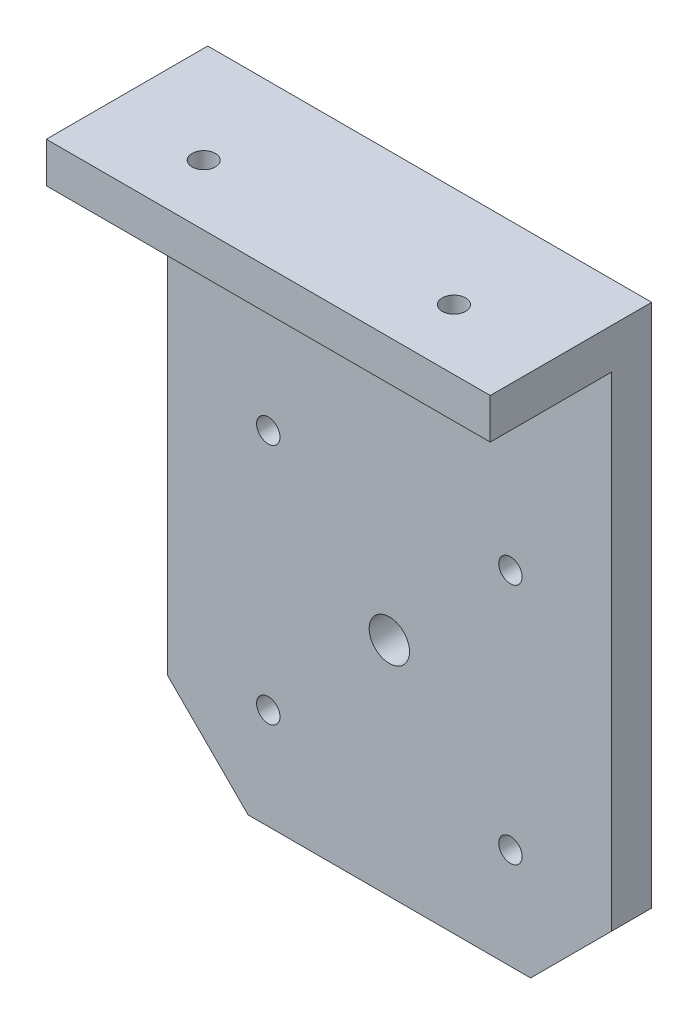
ISO-10303-21;
HEADER;
FILE_DESCRIPTION(('STEP AP214'),'2;1');
FILE_NAME('part.step','',(''),(''),'','','');
FILE_SCHEMA(('AUTOMOTIVE_DESIGN { 1 0 10303 214 1 1 1 1 }'));
ENDSEC;
DATA;
#1=APPLICATION_CONTEXT('core data for automotive mechanical design processes');
#2=APPLICATION_PROTOCOL_DEFINITION('international standard','automotive_design',2000,#1);
#3=PRODUCT_CONTEXT('',#1,'mechanical');
#4=PRODUCT('Part','Part','',(#3));
#5=PRODUCT_RELATED_PRODUCT_CATEGORY('part','',(#4));
#6=PRODUCT_DEFINITION_FORMATION('','',#4);
#7=PRODUCT_DEFINITION_CONTEXT('part definition',#1,'design');
#8=PRODUCT_DEFINITION('design','',#6,#7);
#9=PRODUCT_DEFINITION_SHAPE('','',#8);
#10=(LENGTH_UNIT() NAMED_UNIT(*) SI_UNIT(.MILLI.,.METRE.));
#11=(NAMED_UNIT(*) PLANE_ANGLE_UNIT() SI_UNIT($,.RADIAN.));
#12=(NAMED_UNIT(*) SI_UNIT($,.STERADIAN.) SOLID_ANGLE_UNIT());
#13=UNCERTAINTY_MEASURE_WITH_UNIT(LENGTH_MEASURE(1.E-05),#10,'distance_accuracy_value','');
#14=(GEOMETRIC_REPRESENTATION_CONTEXT(3) GLOBAL_UNCERTAINTY_ASSIGNED_CONTEXT((#13)) GLOBAL_UNIT_ASSIGNED_CONTEXT((#10,
#11,#12)) REPRESENTATION_CONTEXT('',''));
#15=CARTESIAN_POINT('',(0.,0.,0.));
#16=DIRECTION('',(0.,0.,1.));
#17=DIRECTION('',(1.,0.,0.));
#18=AXIS2_PLACEMENT_3D('',#15,#16,#17);
#19=CARTESIAN_POINT('',(-27.5,37.5,5.));
#20=DIRECTION('',(1.,0.,0.));
#21=DIRECTION('',(0.,1.,0.));
#22=AXIS2_PLACEMENT_3D('',#19,#20,#21);
#23=PLANE('',#22);
#24=DIRECTION('',(0.,-1.,0.));
#25=VECTOR('',#24,1.);
#26=CARTESIAN_POINT('',(-27.5,37.5,0.));
#27=LINE('',#26,#25);
#28=CARTESIAN_POINT('',(-27.5,37.5,0.));
#29=VERTEX_POINT('',#28);
#30=CARTESIAN_POINT('',(-27.5,-27.5,0.));
#31=VERTEX_POINT('',#30);
#32=EDGE_CURVE('E147',#29,#31,#27,.T.);
#33=ORIENTED_EDGE('',*,*,#32,.T.);
#34=DIRECTION('',(0.,0.,-1.));
#35=VECTOR('',#34,1.);
#36=CARTESIAN_POINT('',(-27.5,-27.5,5.));
#37=LINE('',#36,#35);
#38=CARTESIAN_POINT('',(-27.5,-27.5,5.));
#39=VERTEX_POINT('',#38);
#40=EDGE_CURVE('E11',#39,#31,#37,.T.);
#41=ORIENTED_EDGE('',*,*,#40,.F.);
#42=DIRECTION('',(0.,-1.,0.));
#43=VECTOR('',#42,1.);
#44=CARTESIAN_POINT('',(-27.5,37.5,5.));
#45=LINE('',#44,#43);
#46=CARTESIAN_POINT('',(-27.5,32.5,5.));
#47=VERTEX_POINT('',#46);
#48=EDGE_CURVE('E88',#47,#39,#45,.T.);
#49=ORIENTED_EDGE('',*,*,#48,.F.);
#50=DIRECTION('',(0.,0.,-1.));
#51=VECTOR('',#50,1.);
#52=CARTESIAN_POINT('',(-27.5,32.5,20.));
#53=LINE('',#52,#51);
#54=CARTESIAN_POINT('',(-27.5,32.5,20.));
#55=VERTEX_POINT('',#54);
#56=EDGE_CURVE('E109',#55,#47,#53,.T.);
#57=ORIENTED_EDGE('',*,*,#56,.F.);
#58=DIRECTION('',(0.,-1.,0.));
#59=VECTOR('',#58,1.);
#60=CARTESIAN_POINT('',(-27.5,37.5,20.));
#61=LINE('',#60,#59);
#62=CARTESIAN_POINT('',(-27.5,37.5,20.));
#63=VERTEX_POINT('',#62);
#64=EDGE_CURVE('E116',#63,#55,#61,.T.);
#65=ORIENTED_EDGE('',*,*,#64,.F.);
#66=DIRECTION('',(0.,0.,-1.));
#67=VECTOR('',#66,1.);
#68=CARTESIAN_POINT('',(-27.5,37.5,5.));
#69=LINE('',#68,#67);
#70=EDGE_CURVE('E163',#63,#29,#69,.T.);
#71=ORIENTED_EDGE('',*,*,#70,.T.);
#72=EDGE_LOOP('',(#33,#41,#49,#57,#65,#71));
#73=FACE_BOUND('',#72,.T.);
#74=ADVANCED_FACE('F33',(#73),#23,.F.);
#75=CARTESIAN_POINT('',(-17.5,-37.5,5.));
#76=DIRECTION('',(0.707106781186548,0.707106781186547,0.));
#77=DIRECTION('',(-0.707106781186547,0.707106781186548,0.));
#78=AXIS2_PLACEMENT_3D('',#75,#76,#77);
#79=PLANE('',#78);
#80=DIRECTION('',(0.707106781186547,-0.707106781186548,0.));
#81=VECTOR('',#80,1.);
#82=CARTESIAN_POINT('',(-17.5,-37.5,0.));
#83=LINE('',#82,#81);
#84=CARTESIAN_POINT('',(-17.5,-37.5,0.));
#85=VERTEX_POINT('',#84);
#86=EDGE_CURVE('E172',#31,#85,#83,.T.);
#87=ORIENTED_EDGE('',*,*,#86,.T.);
#88=DIRECTION('',(0.,0.,-1.));
#89=VECTOR('',#88,1.);
#90=CARTESIAN_POINT('',(-17.5,-37.5,5.));
#91=LINE('',#90,#89);
#92=CARTESIAN_POINT('',(-17.5,-37.5,5.));
#93=VERTEX_POINT('',#92);
#94=EDGE_CURVE('E41',#93,#85,#91,.T.);
#95=ORIENTED_EDGE('',*,*,#94,.F.);
#96=DIRECTION('',(0.707106781186547,-0.707106781186548,0.));
#97=VECTOR('',#96,1.);
#98=CARTESIAN_POINT('',(-17.5,-37.5,5.));
#99=LINE('',#98,#97);
#100=EDGE_CURVE('E150',#39,#93,#99,.T.);
#101=ORIENTED_EDGE('',*,*,#100,.F.);
#102=ORIENTED_EDGE('',*,*,#40,.T.);
#103=EDGE_LOOP('',(#87,#95,#101,#102));
#104=FACE_BOUND('',#103,.T.);
#105=ADVANCED_FACE('F183',(#104),#79,.F.);
#106=CARTESIAN_POINT('',(-17.5,-37.5,5.));
#107=DIRECTION('',(0.,1.,0.));
#108=DIRECTION('',(0.,0.,1.));
#109=AXIS2_PLACEMENT_3D('',#106,#107,#108);
#110=PLANE('',#109);
#111=DIRECTION('',(1.,0.,0.));
#112=VECTOR('',#111,1.);
#113=CARTESIAN_POINT('',(-17.5,-37.5,0.));
#114=LINE('',#113,#112);
#115=CARTESIAN_POINT('',(17.5,-37.5,0.));
#116=VERTEX_POINT('',#115);
#117=EDGE_CURVE('E170',#85,#116,#114,.T.);
#118=ORIENTED_EDGE('',*,*,#117,.T.);
#119=DIRECTION('',(0.,0.,-1.));
#120=VECTOR('',#119,1.);
#121=CARTESIAN_POINT('',(17.5,-37.5,5.));
#122=LINE('',#121,#120);
#123=CARTESIAN_POINT('',(17.5,-37.5,5.));
#124=VERTEX_POINT('',#123);
#125=EDGE_CURVE('E155',#124,#116,#122,.T.);
#126=ORIENTED_EDGE('',*,*,#125,.F.);
#127=DIRECTION('',(1.,0.,0.));
#128=VECTOR('',#127,1.);
#129=CARTESIAN_POINT('',(-17.5,-37.5,5.));
#130=LINE('',#129,#128);
#131=EDGE_CURVE('E176',#93,#124,#130,.T.);
#132=ORIENTED_EDGE('',*,*,#131,.F.);
#133=ORIENTED_EDGE('',*,*,#94,.T.);
#134=EDGE_LOOP('',(#118,#126,#132,#133));
#135=FACE_BOUND('',#134,.T.);
#136=ADVANCED_FACE('F186',(#135),#110,.F.);
#137=CARTESIAN_POINT('',(17.5,-37.5,5.));
#138=DIRECTION('',(-0.707106781186548,0.707106781186547,0.));
#139=DIRECTION('',(-0.707106781186547,-0.707106781186548,0.));
#140=AXIS2_PLACEMENT_3D('',#137,#138,#139);
#141=PLANE('',#140);
#142=DIRECTION('',(0.707106781186547,0.707106781186548,0.));
#143=VECTOR('',#142,1.);
#144=CARTESIAN_POINT('',(17.5,-37.5,0.));
#145=LINE('',#144,#143);
#146=CARTESIAN_POINT('',(27.5,-27.5,0.));
#147=VERTEX_POINT('',#146);
#148=EDGE_CURVE('E168',#116,#147,#145,.T.);
#149=ORIENTED_EDGE('',*,*,#148,.T.);
#150=DIRECTION('',(0.,0.,-1.));
#151=VECTOR('',#150,1.);
#152=CARTESIAN_POINT('',(27.5,-27.5,5.));
#153=LINE('',#152,#151);
#154=CARTESIAN_POINT('',(27.5,-27.5,5.));
#155=VERTEX_POINT('',#154);
#156=EDGE_CURVE('E158',#155,#147,#153,.T.);
#157=ORIENTED_EDGE('',*,*,#156,.F.);
#158=DIRECTION('',(0.707106781186547,0.707106781186548,0.));
#159=VECTOR('',#158,1.);
#160=CARTESIAN_POINT('',(17.5,-37.5,5.));
#161=LINE('',#160,#159);
#162=EDGE_CURVE('E56',#124,#155,#161,.T.);
#163=ORIENTED_EDGE('',*,*,#162,.F.);
#164=ORIENTED_EDGE('',*,*,#125,.T.);
#165=EDGE_LOOP('',(#149,#157,#163,#164));
#166=FACE_BOUND('',#165,.T.);
#167=ADVANCED_FACE('F189',(#166),#141,.F.);
#168=CARTESIAN_POINT('',(27.5,37.5,5.));
#169=DIRECTION('',(-1.,0.,0.));
#170=DIRECTION('',(0.,-1.,0.));
#171=AXIS2_PLACEMENT_3D('',#168,#169,#170);
#172=PLANE('',#171);
#173=DIRECTION('',(0.,1.,0.));
#174=VECTOR('',#173,1.);
#175=CARTESIAN_POINT('',(27.5,37.5,0.));
#176=LINE('',#175,#174);
#177=CARTESIAN_POINT('',(27.5,37.5,0.));
#178=VERTEX_POINT('',#177);
#179=EDGE_CURVE('E166',#147,#178,#176,.T.);
#180=ORIENTED_EDGE('',*,*,#179,.T.);
#181=DIRECTION('',(0.,0.,-1.));
#182=VECTOR('',#181,1.);
#183=CARTESIAN_POINT('',(27.5,37.5,5.));
#184=LINE('',#183,#182);
#185=CARTESIAN_POINT('',(27.5,37.5,20.));
#186=VERTEX_POINT('',#185);
#187=EDGE_CURVE('E161',#186,#178,#184,.T.);
#188=ORIENTED_EDGE('',*,*,#187,.F.);
#189=DIRECTION('',(0.,1.,0.));
#190=VECTOR('',#189,1.);
#191=CARTESIAN_POINT('',(27.5,37.5,20.));
#192=LINE('',#191,#190);
#193=CARTESIAN_POINT('',(27.5,32.5,20.));
#194=VERTEX_POINT('',#193);
#195=EDGE_CURVE('E115',#194,#186,#192,.T.);
#196=ORIENTED_EDGE('',*,*,#195,.F.);
#197=DIRECTION('',(0.,0.,-1.));
#198=VECTOR('',#197,1.);
#199=CARTESIAN_POINT('',(27.5,32.5,20.));
#200=LINE('',#199,#198);
#201=CARTESIAN_POINT('',(27.5,32.5,5.));
#202=VERTEX_POINT('',#201);
#203=EDGE_CURVE('E111',#194,#202,#200,.T.);
#204=ORIENTED_EDGE('',*,*,#203,.T.);
#205=DIRECTION('',(0.,1.,0.));
#206=VECTOR('',#205,1.);
#207=CARTESIAN_POINT('',(27.5,37.5,5.));
#208=LINE('',#207,#206);
#209=EDGE_CURVE('E138',#155,#202,#208,.T.);
#210=ORIENTED_EDGE('',*,*,#209,.F.);
#211=ORIENTED_EDGE('',*,*,#156,.T.);
#212=EDGE_LOOP('',(#180,#188,#196,#204,#210,#211));
#213=FACE_BOUND('',#212,.T.);
#214=ADVANCED_FACE('F193',(#213),#172,.F.);
#215=CARTESIAN_POINT('',(-27.5,37.5,5.));
#216=DIRECTION('',(0.,-1.,0.));
#217=DIRECTION('',(0.,0.,-1.));
#218=AXIS2_PLACEMENT_3D('',#215,#216,#217);
#219=PLANE('',#218);
#220=CARTESIAN_POINT('',(15.5,37.5,12.5));
#221=DIRECTION('',(0.,-1.,0.));
#222=DIRECTION('',(0.,0.,-1.));
#223=AXIS2_PLACEMENT_3D('',#220,#221,#222);
#224=CIRCLE('',#223,1.44999999999999);
#225=CARTESIAN_POINT('',(15.5,37.5,11.05));
#226=VERTEX_POINT('',#225);
#227=EDGE_CURVE('E203',#226,#226,#224,.T.);
#228=ORIENTED_EDGE('',*,*,#227,.T.);
#229=EDGE_LOOP('',(#228));
#230=FACE_BOUND('',#229,.T.);
#231=CARTESIAN_POINT('',(-15.5,37.5,12.5));
#232=DIRECTION('',(0.,-1.,0.));
#233=DIRECTION('',(0.,0.,-1.));
#234=AXIS2_PLACEMENT_3D('',#231,#232,#233);
#235=CIRCLE('',#234,1.44999999999999);
#236=CARTESIAN_POINT('',(-15.5,37.5,11.05));
#237=VERTEX_POINT('',#236);
#238=EDGE_CURVE('E137',#237,#237,#235,.T.);
#239=ORIENTED_EDGE('',*,*,#238,.T.);
#240=EDGE_LOOP('',(#239));
#241=FACE_BOUND('',#240,.T.);
#242=DIRECTION('',(-1.,0.,0.));
#243=VECTOR('',#242,1.);
#244=CARTESIAN_POINT('',(-27.5,37.5,0.));
#245=LINE('',#244,#243);
#246=EDGE_CURVE('E84',#178,#29,#245,.T.);
#247=ORIENTED_EDGE('',*,*,#246,.T.);
#248=ORIENTED_EDGE('',*,*,#70,.F.);
#249=DIRECTION('',(-1.,0.,0.));
#250=VECTOR('',#249,1.);
#251=CARTESIAN_POINT('',(-27.5,37.5,20.));
#252=LINE('',#251,#250);
#253=EDGE_CURVE('E122',#186,#63,#252,.T.);
#254=ORIENTED_EDGE('',*,*,#253,.F.);
#255=ORIENTED_EDGE('',*,*,#187,.T.);
#256=EDGE_LOOP('',(#247,#248,#254,#255));
#257=FACE_BOUND('',#256,.T.);
#258=ADVANCED_FACE('F265',(#230,#241,#257),#219,.F.);
#259=CARTESIAN_POINT('',(0.,0.,5.));
#260=DIRECTION('',(0.,0.,1.));
#261=DIRECTION('',(1.,0.,0.));
#262=AXIS2_PLACEMENT_3D('',#259,#260,#261);
#263=PLANE('',#262);
#264=CARTESIAN_POINT('',(14.9999999999999,4.99999999999999,5.));
#265=DIRECTION('',(0.,0.,1.));
#266=DIRECTION('',(1.,0.,0.));
#267=AXIS2_PLACEMENT_3D('',#264,#265,#266);
#268=CIRCLE('',#267,1.44999999999999);
#269=CARTESIAN_POINT('',(16.4499999999999,4.99999999999999,5.));
#270=VERTEX_POINT('',#269);
#271=EDGE_CURVE('E239',#270,#270,#268,.T.);
#272=ORIENTED_EDGE('',*,*,#271,.F.);
#273=EDGE_LOOP('',(#272));
#274=FACE_BOUND('',#273,.T.);
#275=CARTESIAN_POINT('',(-15.0000000000001,4.99999999999999,5.));
#276=DIRECTION('',(0.,0.,1.));
#277=DIRECTION('',(1.,0.,0.));
#278=AXIS2_PLACEMENT_3D('',#275,#276,#277);
#279=CIRCLE('',#278,1.44999999999999);
#280=CARTESIAN_POINT('',(-13.5500000000001,4.99999999999999,5.));
#281=VERTEX_POINT('',#280);
#282=EDGE_CURVE('E230',#281,#281,#279,.T.);
#283=ORIENTED_EDGE('',*,*,#282,.F.);
#284=EDGE_LOOP('',(#283));
#285=FACE_BOUND('',#284,.T.);
#286=CARTESIAN_POINT('',(14.9999999999999,-25.,5.));
#287=DIRECTION('',(0.,0.,1.));
#288=DIRECTION('',(1.,0.,0.));
#289=AXIS2_PLACEMENT_3D('',#286,#287,#288);
#290=CIRCLE('',#289,1.44999999999999);
#291=CARTESIAN_POINT('',(16.4499999999999,-25.,5.));
#292=VERTEX_POINT('',#291);
#293=EDGE_CURVE('E221',#292,#292,#290,.T.);
#294=ORIENTED_EDGE('',*,*,#293,.F.);
#295=EDGE_LOOP('',(#294));
#296=FACE_BOUND('',#295,.T.);
#297=CARTESIAN_POINT('',(-15.0000000000001,-25.,5.));
#298=DIRECTION('',(0.,0.,1.));
#299=DIRECTION('',(1.,0.,0.));
#300=AXIS2_PLACEMENT_3D('',#297,#298,#299);
#301=CIRCLE('',#300,1.44999999999999);
#302=CARTESIAN_POINT('',(-13.5500000000001,-25.,5.));
#303=VERTEX_POINT('',#302);
#304=EDGE_CURVE('E212',#303,#303,#301,.T.);
#305=ORIENTED_EDGE('',*,*,#304,.F.);
#306=EDGE_LOOP('',(#305));
#307=FACE_BOUND('',#306,.T.);
#308=DIRECTION('',(1.,0.,0.));
#309=VECTOR('',#308,1.);
#310=CARTESIAN_POINT('',(-27.5,32.5,5.));
#311=LINE('',#310,#309);
#312=EDGE_CURVE('E49',#47,#202,#311,.T.);
#313=ORIENTED_EDGE('',*,*,#312,.F.);
#314=ORIENTED_EDGE('',*,*,#48,.T.);
#315=ORIENTED_EDGE('',*,*,#100,.T.);
#316=ORIENTED_EDGE('',*,*,#131,.T.);
#317=ORIENTED_EDGE('',*,*,#162,.T.);
#318=ORIENTED_EDGE('',*,*,#209,.T.);
#319=EDGE_LOOP('',(#313,#314,#315,#316,#317,#318));
#320=FACE_BOUND('',#319,.T.);
#321=CARTESIAN_POINT('',(0.,-10.,5.));
#322=DIRECTION('',(0.,0.,1.));
#323=DIRECTION('',(1.,0.,0.));
#324=AXIS2_PLACEMENT_3D('',#321,#322,#323);
#325=CIRCLE('',#324,2.5);
#326=CARTESIAN_POINT('',(2.5,-10.,5.));
#327=VERTEX_POINT('',#326);
#328=EDGE_CURVE('E127',#327,#327,#325,.T.);
#329=ORIENTED_EDGE('',*,*,#328,.F.);
#330=EDGE_LOOP('',(#329));
#331=FACE_BOUND('',#330,.T.);
#332=ADVANCED_FACE('F180',(#274,#285,#296,#307,#320,#331),#263,.T.);
#333=CARTESIAN_POINT('',(0.,0.,0.));
#334=DIRECTION('',(0.,0.,1.));
#335=DIRECTION('',(1.,0.,0.));
#336=AXIS2_PLACEMENT_3D('',#333,#334,#335);
#337=PLANE('',#336);
#338=CARTESIAN_POINT('',(14.9999999999999,4.99999999999999,0.));
#339=DIRECTION('',(0.,0.,-1.));
#340=DIRECTION('',(-1.,0.,0.));
#341=AXIS2_PLACEMENT_3D('',#338,#339,#340);
#342=CIRCLE('',#341,2.75);
#343=CARTESIAN_POINT('',(12.2499999999999,4.99999999999999,0.));
#344=VERTEX_POINT('',#343);
#345=EDGE_CURVE('E245',#344,#344,#342,.T.);
#346=ORIENTED_EDGE('',*,*,#345,.F.);
#347=EDGE_LOOP('',(#346));
#348=FACE_BOUND('',#347,.T.);
#349=CARTESIAN_POINT('',(-15.0000000000001,4.99999999999999,0.));
#350=DIRECTION('',(0.,0.,-1.));
#351=DIRECTION('',(-1.,0.,0.));
#352=AXIS2_PLACEMENT_3D('',#349,#350,#351);
#353=CIRCLE('',#352,2.75);
#354=CARTESIAN_POINT('',(-17.7500000000001,4.99999999999999,0.));
#355=VERTEX_POINT('',#354);
#356=EDGE_CURVE('E236',#355,#355,#353,.T.);
#357=ORIENTED_EDGE('',*,*,#356,.F.);
#358=EDGE_LOOP('',(#357));
#359=FACE_BOUND('',#358,.T.);
#360=CARTESIAN_POINT('',(14.9999999999999,-25.,0.));
#361=DIRECTION('',(0.,0.,-1.));
#362=DIRECTION('',(-1.,0.,0.));
#363=AXIS2_PLACEMENT_3D('',#360,#361,#362);
#364=CIRCLE('',#363,2.75);
#365=CARTESIAN_POINT('',(12.2499999999999,-25.,0.));
#366=VERTEX_POINT('',#365);
#367=EDGE_CURVE('E227',#366,#366,#364,.T.);
#368=ORIENTED_EDGE('',*,*,#367,.F.);
#369=EDGE_LOOP('',(#368));
#370=FACE_BOUND('',#369,.T.);
#371=CARTESIAN_POINT('',(-15.0000000000001,-25.,0.));
#372=DIRECTION('',(0.,0.,-1.));
#373=DIRECTION('',(-1.,0.,0.));
#374=AXIS2_PLACEMENT_3D('',#371,#372,#373);
#375=CIRCLE('',#374,2.75);
#376=CARTESIAN_POINT('',(-17.7500000000001,-25.,0.));
#377=VERTEX_POINT('',#376);
#378=EDGE_CURVE('E218',#377,#377,#375,.T.);
#379=ORIENTED_EDGE('',*,*,#378,.F.);
#380=EDGE_LOOP('',(#379));
#381=FACE_BOUND('',#380,.T.);
#382=CARTESIAN_POINT('',(0.,-10.,0.));
#383=DIRECTION('',(0.,0.,1.));
#384=DIRECTION('',(1.,0.,0.));
#385=AXIS2_PLACEMENT_3D('',#382,#383,#384);
#386=CIRCLE('',#385,2.5);
#387=CARTESIAN_POINT('',(2.5,-10.,0.));
#388=VERTEX_POINT('',#387);
#389=EDGE_CURVE('E129',#388,#388,#386,.F.);
#390=ORIENTED_EDGE('',*,*,#389,.F.);
#391=EDGE_LOOP('',(#390));
#392=FACE_BOUND('',#391,.T.);
#393=ORIENTED_EDGE('',*,*,#32,.F.);
#394=ORIENTED_EDGE('',*,*,#246,.F.);
#395=ORIENTED_EDGE('',*,*,#179,.F.);
#396=ORIENTED_EDGE('',*,*,#148,.F.);
#397=ORIENTED_EDGE('',*,*,#117,.F.);
#398=ORIENTED_EDGE('',*,*,#86,.F.);
#399=EDGE_LOOP('',(#393,#394,#395,#396,#397,#398));
#400=FACE_BOUND('',#399,.T.);
#401=ADVANCED_FACE('F251',(#348,#359,#370,#381,#392,#400),#337,.F.);
#402=CARTESIAN_POINT('',(0.,-10.,-0.00100000000000013));
#403=DIRECTION('',(0.,0.,1.));
#404=DIRECTION('',(1.,0.,0.));
#405=AXIS2_PLACEMENT_3D('',#402,#403,#404);
#406=CYLINDRICAL_SURFACE('',#405,2.5);
#407=ORIENTED_EDGE('',*,*,#328,.T.);
#408=EDGE_LOOP('',(#407));
#409=FACE_BOUND('',#408,.T.);
#410=ORIENTED_EDGE('',*,*,#389,.T.);
#411=EDGE_LOOP('',(#410));
#412=FACE_BOUND('',#411,.T.);
#413=ADVANCED_FACE('F254',(#409,#412),#406,.F.);
#414=CARTESIAN_POINT('',(-27.5,32.5,20.));
#415=DIRECTION('',(0.,1.,0.));
#416=DIRECTION('',(0.,0.,1.));
#417=AXIS2_PLACEMENT_3D('',#414,#415,#416);
#418=PLANE('',#417);
#419=CARTESIAN_POINT('',(15.5,32.5,12.5));
#420=DIRECTION('',(0.,-1.,0.));
#421=DIRECTION('',(0.,0.,-1.));
#422=AXIS2_PLACEMENT_3D('',#419,#420,#421);
#423=CIRCLE('',#422,2.75);
#424=CARTESIAN_POINT('',(15.5,32.5,9.75));
#425=VERTEX_POINT('',#424);
#426=EDGE_CURVE('E209',#425,#425,#423,.T.);
#427=ORIENTED_EDGE('',*,*,#426,.F.);
#428=EDGE_LOOP('',(#427));
#429=FACE_BOUND('',#428,.T.);
#430=CARTESIAN_POINT('',(-15.5,32.5,12.5));
#431=DIRECTION('',(0.,-1.,0.));
#432=DIRECTION('',(0.,0.,-1.));
#433=AXIS2_PLACEMENT_3D('',#430,#431,#432);
#434=CIRCLE('',#433,2.75);
#435=CARTESIAN_POINT('',(-15.5,32.5,9.75));
#436=VERTEX_POINT('',#435);
#437=EDGE_CURVE('E200',#436,#436,#434,.T.);
#438=ORIENTED_EDGE('',*,*,#437,.F.);
#439=EDGE_LOOP('',(#438));
#440=FACE_BOUND('',#439,.T.);
#441=ORIENTED_EDGE('',*,*,#312,.T.);
#442=ORIENTED_EDGE('',*,*,#203,.F.);
#443=DIRECTION('',(1.,0.,0.));
#444=VECTOR('',#443,1.);
#445=CARTESIAN_POINT('',(-27.5,32.5,20.));
#446=LINE('',#445,#444);
#447=EDGE_CURVE('E105',#55,#194,#446,.T.);
#448=ORIENTED_EDGE('',*,*,#447,.F.);
#449=ORIENTED_EDGE('',*,*,#56,.T.);
#450=EDGE_LOOP('',(#441,#442,#448,#449));
#451=FACE_BOUND('',#450,.T.);
#452=ADVANCED_FACE('F107',(#429,#440,#451),#418,.F.);
#453=CARTESIAN_POINT('',(0.,0.,20.));
#454=DIRECTION('',(0.,0.,1.));
#455=DIRECTION('',(1.,0.,0.));
#456=AXIS2_PLACEMENT_3D('',#453,#454,#455);
#457=PLANE('',#456);
#458=ORIENTED_EDGE('',*,*,#64,.T.);
#459=ORIENTED_EDGE('',*,*,#447,.T.);
#460=ORIENTED_EDGE('',*,*,#195,.T.);
#461=ORIENTED_EDGE('',*,*,#253,.T.);
#462=EDGE_LOOP('',(#458,#459,#460,#461));
#463=FACE_BOUND('',#462,.T.);
#464=ADVANCED_FACE('F120',(#463),#457,.T.);
#465=CARTESIAN_POINT('',(-15.5,32.5,12.5));
#466=DIRECTION('',(0.,-1.,0.));
#467=DIRECTION('',(0.,0.,-1.));
#468=AXIS2_PLACEMENT_3D('',#465,#466,#467);
#469=CYLINDRICAL_SURFACE('',#468,1.44999999999999);
#470=ORIENTED_EDGE('',*,*,#238,.F.);
#471=EDGE_LOOP('',(#470));
#472=FACE_BOUND('',#471,.T.);
#473=CARTESIAN_POINT('',(-15.5,33.8,12.5));
#474=DIRECTION('',(0.,-1.,0.));
#475=DIRECTION('',(0.,0.,-1.));
#476=AXIS2_PLACEMENT_3D('',#473,#474,#475);
#477=CIRCLE('',#476,1.44999999999999);
#478=CARTESIAN_POINT('',(-15.5,33.8,11.05));
#479=VERTEX_POINT('',#478);
#480=EDGE_CURVE('E197',#479,#479,#477,.T.);
#481=ORIENTED_EDGE('',*,*,#480,.T.);
#482=EDGE_LOOP('',(#481));
#483=FACE_BOUND('',#482,.T.);
#484=ADVANCED_FACE('F338',(#472,#483),#469,.F.);
#485=CARTESIAN_POINT('',(-15.5,32.5,12.5));
#486=DIRECTION('',(0.,-1.,0.));
#487=DIRECTION('',(0.,0.,-1.));
#488=AXIS2_PLACEMENT_3D('',#485,#486,#487);
#489=CONICAL_SURFACE('',#488,2.75,0.785398163397449);
#490=ORIENTED_EDGE('',*,*,#480,.F.);
#491=EDGE_LOOP('',(#490));
#492=FACE_BOUND('',#491,.T.);
#493=ORIENTED_EDGE('',*,*,#437,.T.);
#494=EDGE_LOOP('',(#493));
#495=FACE_BOUND('',#494,.T.);
#496=ADVANCED_FACE('F343',(#492,#495),#489,.F.);
#497=CARTESIAN_POINT('',(15.5,32.5,12.5));
#498=DIRECTION('',(0.,-1.,0.));
#499=DIRECTION('',(0.,0.,-1.));
#500=AXIS2_PLACEMENT_3D('',#497,#498,#499);
#501=CYLINDRICAL_SURFACE('',#500,1.44999999999999);
#502=ORIENTED_EDGE('',*,*,#227,.F.);
#503=EDGE_LOOP('',(#502));
#504=FACE_BOUND('',#503,.T.);
#505=CARTESIAN_POINT('',(15.5,33.8,12.5));
#506=DIRECTION('',(0.,-1.,0.));
#507=DIRECTION('',(0.,0.,-1.));
#508=AXIS2_PLACEMENT_3D('',#505,#506,#507);
#509=CIRCLE('',#508,1.44999999999999);
#510=CARTESIAN_POINT('',(15.5,33.8,11.05));
#511=VERTEX_POINT('',#510);
#512=EDGE_CURVE('E206',#511,#511,#509,.T.);
#513=ORIENTED_EDGE('',*,*,#512,.T.);
#514=EDGE_LOOP('',(#513));
#515=FACE_BOUND('',#514,.T.);
#516=ADVANCED_FACE('F351',(#504,#515),#501,.F.);
#517=CARTESIAN_POINT('',(15.5,32.5,12.5));
#518=DIRECTION('',(0.,-1.,0.));
#519=DIRECTION('',(0.,0.,-1.));
#520=AXIS2_PLACEMENT_3D('',#517,#518,#519);
#521=CONICAL_SURFACE('',#520,2.75,0.78539816339745);
#522=ORIENTED_EDGE('',*,*,#512,.F.);
#523=EDGE_LOOP('',(#522));
#524=FACE_BOUND('',#523,.T.);
#525=ORIENTED_EDGE('',*,*,#426,.T.);
#526=EDGE_LOOP('',(#525));
#527=FACE_BOUND('',#526,.T.);
#528=ADVANCED_FACE('F359',(#524,#527),#521,.F.);
#529=CARTESIAN_POINT('',(-15.0000000000001,-25.,0.));
#530=DIRECTION('',(0.,0.,-1.));
#531=DIRECTION('',(-1.,0.,0.));
#532=AXIS2_PLACEMENT_3D('',#529,#530,#531);
#533=CYLINDRICAL_SURFACE('',#532,1.44999999999999);
#534=CARTESIAN_POINT('',(-15.0000000000001,-25.,1.30000000000001));
#535=DIRECTION('',(0.,0.,-1.));
#536=DIRECTION('',(-1.,0.,0.));
#537=AXIS2_PLACEMENT_3D('',#534,#535,#536);
#538=CIRCLE('',#537,1.44999999999999);
#539=CARTESIAN_POINT('',(-16.4500000000001,-25.,1.30000000000001));
#540=VERTEX_POINT('',#539);
#541=EDGE_CURVE('E215',#540,#540,#538,.T.);
#542=ORIENTED_EDGE('',*,*,#541,.T.);
#543=EDGE_LOOP('',(#542));
#544=FACE_BOUND('',#543,.T.);
#545=ORIENTED_EDGE('',*,*,#304,.T.);
#546=EDGE_LOOP('',(#545));
#547=FACE_BOUND('',#546,.T.);
#548=ADVANCED_FACE('F366',(#544,#547),#533,.F.);
#549=CARTESIAN_POINT('',(-15.0000000000001,-25.,0.));
#550=DIRECTION('',(0.,0.,-1.));
#551=DIRECTION('',(-1.,0.,0.));
#552=AXIS2_PLACEMENT_3D('',#549,#550,#551);
#553=CONICAL_SURFACE('',#552,2.75,0.785398163397448);
#554=ORIENTED_EDGE('',*,*,#541,.F.);
#555=EDGE_LOOP('',(#554));
#556=FACE_BOUND('',#555,.T.);
#557=ORIENTED_EDGE('',*,*,#378,.T.);
#558=EDGE_LOOP('',(#557));
#559=FACE_BOUND('',#558,.T.);
#560=ADVANCED_FACE('F373',(#556,#559),#553,.F.);
#561=CARTESIAN_POINT('',(14.9999999999999,-25.,0.));
#562=DIRECTION('',(0.,0.,-1.));
#563=DIRECTION('',(-1.,0.,0.));
#564=AXIS2_PLACEMENT_3D('',#561,#562,#563);
#565=CYLINDRICAL_SURFACE('',#564,1.44999999999999);
#566=CARTESIAN_POINT('',(14.9999999999999,-25.,1.30000000000001));
#567=DIRECTION('',(0.,0.,-1.));
#568=DIRECTION('',(-1.,0.,0.));
#569=AXIS2_PLACEMENT_3D('',#566,#567,#568);
#570=CIRCLE('',#569,1.44999999999999);
#571=CARTESIAN_POINT('',(13.5499999999999,-25.,1.30000000000001));
#572=VERTEX_POINT('',#571);
#573=EDGE_CURVE('E224',#572,#572,#570,.T.);
#574=ORIENTED_EDGE('',*,*,#573,.T.);
#575=EDGE_LOOP('',(#574));
#576=FACE_BOUND('',#575,.T.);
#577=ORIENTED_EDGE('',*,*,#293,.T.);
#578=EDGE_LOOP('',(#577));
#579=FACE_BOUND('',#578,.T.);
#580=ADVANCED_FACE('F381',(#576,#579),#565,.F.);
#581=CARTESIAN_POINT('',(14.9999999999999,-25.,0.));
#582=DIRECTION('',(0.,0.,-1.));
#583=DIRECTION('',(-1.,0.,0.));
#584=AXIS2_PLACEMENT_3D('',#581,#582,#583);
#585=CONICAL_SURFACE('',#584,2.75,0.785398163397449);
#586=ORIENTED_EDGE('',*,*,#573,.F.);
#587=EDGE_LOOP('',(#586));
#588=FACE_BOUND('',#587,.T.);
#589=ORIENTED_EDGE('',*,*,#367,.T.);
#590=EDGE_LOOP('',(#589));
#591=FACE_BOUND('',#590,.T.);
#592=ADVANCED_FACE('F389',(#588,#591),#585,.F.);
#593=CARTESIAN_POINT('',(-15.0000000000001,4.99999999999999,0.));
#594=DIRECTION('',(0.,0.,-1.));
#595=DIRECTION('',(-1.,0.,0.));
#596=AXIS2_PLACEMENT_3D('',#593,#594,#595);
#597=CYLINDRICAL_SURFACE('',#596,1.44999999999999);
#598=CARTESIAN_POINT('',(-15.0000000000001,4.99999999999999,1.30000000000001));
#599=DIRECTION('',(0.,0.,-1.));
#600=DIRECTION('',(-1.,0.,0.));
#601=AXIS2_PLACEMENT_3D('',#598,#599,#600);
#602=CIRCLE('',#601,1.44999999999999);
#603=CARTESIAN_POINT('',(-16.4500000000001,4.99999999999999,1.30000000000001));
#604=VERTEX_POINT('',#603);
#605=EDGE_CURVE('E233',#604,#604,#602,.T.);
#606=ORIENTED_EDGE('',*,*,#605,.T.);
#607=EDGE_LOOP('',(#606));
#608=FACE_BOUND('',#607,.T.);
#609=ORIENTED_EDGE('',*,*,#282,.T.);
#610=EDGE_LOOP('',(#609));
#611=FACE_BOUND('',#610,.T.);
#612=ADVANCED_FACE('F397',(#608,#611),#597,.F.);
#613=CARTESIAN_POINT('',(-15.0000000000001,4.99999999999999,0.));
#614=DIRECTION('',(0.,0.,-1.));
#615=DIRECTION('',(-1.,0.,0.));
#616=AXIS2_PLACEMENT_3D('',#613,#614,#615);
#617=CONICAL_SURFACE('',#616,2.75,0.785398163397448);
#618=ORIENTED_EDGE('',*,*,#605,.F.);
#619=EDGE_LOOP('',(#618));
#620=FACE_BOUND('',#619,.T.);
#621=ORIENTED_EDGE('',*,*,#356,.T.);
#622=EDGE_LOOP('',(#621));
#623=FACE_BOUND('',#622,.T.);
#624=ADVANCED_FACE('F405',(#620,#623),#617,.F.);
#625=CARTESIAN_POINT('',(14.9999999999999,4.99999999999999,0.));
#626=DIRECTION('',(0.,0.,-1.));
#627=DIRECTION('',(-1.,0.,0.));
#628=AXIS2_PLACEMENT_3D('',#625,#626,#627);
#629=CYLINDRICAL_SURFACE('',#628,1.44999999999999);
#630=CARTESIAN_POINT('',(14.9999999999999,4.99999999999999,1.30000000000001));
#631=DIRECTION('',(0.,0.,-1.));
#632=DIRECTION('',(-1.,0.,0.));
#633=AXIS2_PLACEMENT_3D('',#630,#631,#632);
#634=CIRCLE('',#633,1.44999999999999);
#635=CARTESIAN_POINT('',(13.5499999999999,4.99999999999999,1.30000000000001));
#636=VERTEX_POINT('',#635);
#637=EDGE_CURVE('E242',#636,#636,#634,.T.);
#638=ORIENTED_EDGE('',*,*,#637,.T.);
#639=EDGE_LOOP('',(#638));
#640=FACE_BOUND('',#639,.T.);
#641=ORIENTED_EDGE('',*,*,#271,.T.);
#642=EDGE_LOOP('',(#641));
#643=FACE_BOUND('',#642,.T.);
#644=ADVANCED_FACE('F413',(#640,#643),#629,.F.);
#645=CARTESIAN_POINT('',(14.9999999999999,4.99999999999999,0.));
#646=DIRECTION('',(0.,0.,-1.));
#647=DIRECTION('',(-1.,0.,0.));
#648=AXIS2_PLACEMENT_3D('',#645,#646,#647);
#649=CONICAL_SURFACE('',#648,2.75,0.785398163397448);
#650=ORIENTED_EDGE('',*,*,#637,.F.);
#651=EDGE_LOOP('',(#650));
#652=FACE_BOUND('',#651,.T.);
#653=ORIENTED_EDGE('',*,*,#345,.T.);
#654=EDGE_LOOP('',(#653));
#655=FACE_BOUND('',#654,.T.);
#656=ADVANCED_FACE('F249',(#652,#655),#649,.F.);
#657=CLOSED_SHELL('',(#74,#105,#136,#167,#214,#258,#332,#401,#413,#452,#464,#484,#496,#516,#528,
#548,#560,#580,#592,#612,#624,#644,#656));
#658=MANIFOLD_SOLID_BREP('B2',#657);
#659=ADVANCED_BREP_SHAPE_REPRESENTATION('',(#18,#658),#14);
#660=SHAPE_DEFINITION_REPRESENTATION(#9,#659);
ENDSEC;
END-ISO-10303-21;
